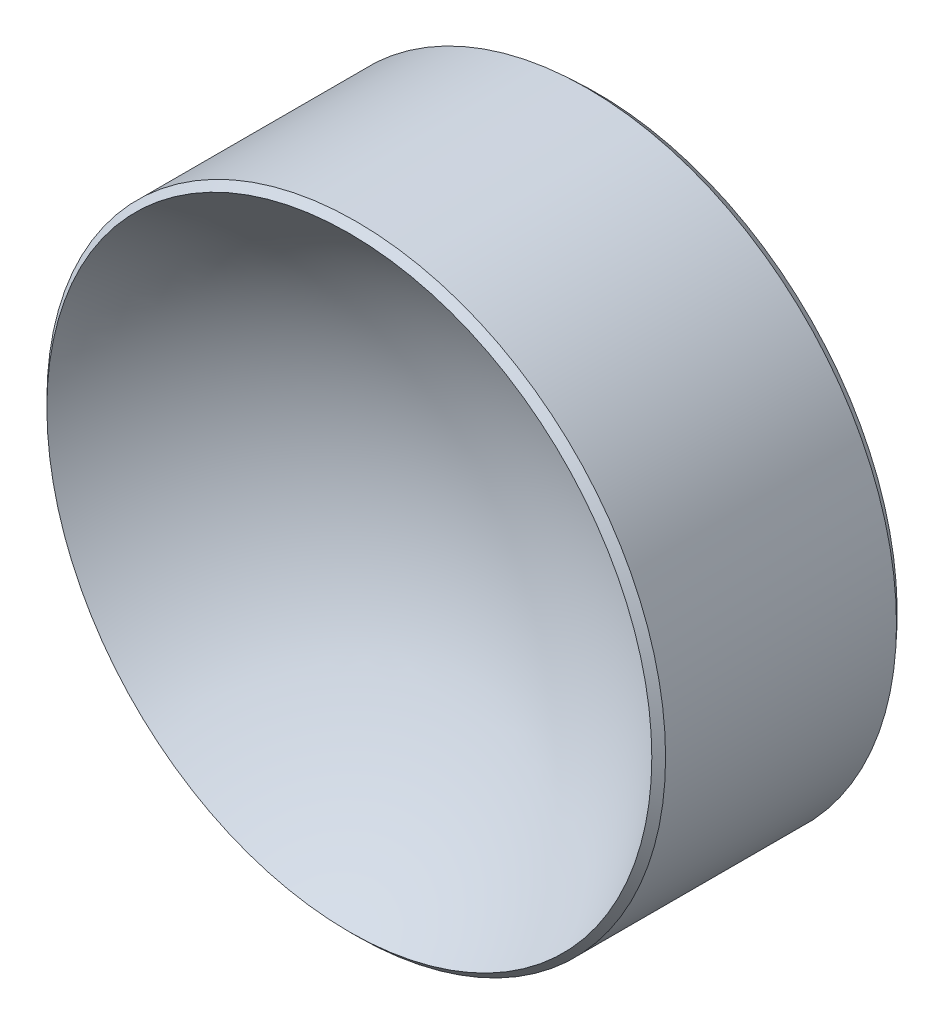
ISO-10303-21;
HEADER;
FILE_DESCRIPTION(('STEP AP214'),'2;1');
FILE_NAME('part.step','',(''),(''),'','','');
FILE_SCHEMA(('AUTOMOTIVE_DESIGN { 1 0 10303 214 1 1 1 1 }'));
ENDSEC;
DATA;
#1=APPLICATION_CONTEXT('core data for automotive mechanical design processes');
#2=APPLICATION_PROTOCOL_DEFINITION('international standard','automotive_design',2000,#1);
#3=PRODUCT_CONTEXT('',#1,'mechanical');
#4=PRODUCT('Part','Part','',(#3));
#5=PRODUCT_RELATED_PRODUCT_CATEGORY('part','',(#4));
#6=PRODUCT_DEFINITION_FORMATION('','',#4);
#7=PRODUCT_DEFINITION_CONTEXT('part definition',#1,'design');
#8=PRODUCT_DEFINITION('design','',#6,#7);
#9=PRODUCT_DEFINITION_SHAPE('','',#8);
#10=(LENGTH_UNIT() NAMED_UNIT(*) SI_UNIT(.MILLI.,.METRE.));
#11=(NAMED_UNIT(*) PLANE_ANGLE_UNIT() SI_UNIT($,.RADIAN.));
#12=(NAMED_UNIT(*) SI_UNIT($,.STERADIAN.) SOLID_ANGLE_UNIT());
#13=UNCERTAINTY_MEASURE_WITH_UNIT(LENGTH_MEASURE(1.E-05),#10,'distance_accuracy_value','');
#14=(GEOMETRIC_REPRESENTATION_CONTEXT(3) GLOBAL_UNCERTAINTY_ASSIGNED_CONTEXT((#13)) GLOBAL_UNIT_ASSIGNED_CONTEXT((#10,
#11,#12)) REPRESENTATION_CONTEXT('',''));
#15=CARTESIAN_POINT('',(0.,0.,0.));
#16=DIRECTION('',(0.,0.,1.));
#17=DIRECTION('',(1.,0.,0.));
#18=AXIS2_PLACEMENT_3D('',#15,#16,#17);
#19=CARTESIAN_POINT('',(0.,0.,6.74546360528074));
#20=DIRECTION('',(0.,0.,1.));
#21=DIRECTION('',(0.,1.,0.));
#22=AXIS2_PLACEMENT_3D('',#19,#20,#21);
#23=SPHERICAL_SURFACE('',#22,7.50000000000001);
#24=CARTESIAN_POINT('',(0.,0.,2.53790478522678));
#25=DIRECTION('',(0.,0.,1.));
#26=DIRECTION('',(0.,-1.,0.));
#27=AXIS2_PLACEMENT_3D('',#24,#25,#26);
#28=CIRCLE('',#27,6.20857864376269);
#29=CARTESIAN_POINT('',(0.,-6.20857864376269,2.53790478522678));
#30=VERTEX_POINT('',#29);
#31=EDGE_CURVE('E28',#30,#30,#28,.T.);
#32=ORIENTED_EDGE('',*,*,#31,.T.);
#33=EDGE_LOOP('',(#32));
#34=FACE_BOUND('',#33,.T.);
#35=ADVANCED_FACE('F13',(#34),#23,.F.);
#36=CARTESIAN_POINT('',(0.,0.,92.8104636052807));
#37=DIRECTION('',(0.,0.,1.));
#38=DIRECTION('',(0.,-1.,0.));
#39=AXIS2_PLACEMENT_3D('',#36,#37,#38);
#40=SPHERICAL_SURFACE('',#39,95.565);
#41=CARTESIAN_POINT('',(0.,0.,-2.55640023880257));
#42=DIRECTION('',(0.,0.,1.));
#43=DIRECTION('',(0.,-1.,0.));
#44=AXIS2_PLACEMENT_3D('',#41,#42,#43);
#45=CIRCLE('',#44,6.15065082280505);
#46=CARTESIAN_POINT('',(0.,-6.15065082280503,-2.55640023880257));
#47=VERTEX_POINT('',#46);
#48=EDGE_CURVE('E9',#47,#47,#45,.F.);
#49=ORIENTED_EDGE('',*,*,#48,.T.);
#50=EDGE_LOOP('',(#49));
#51=FACE_BOUND('',#50,.T.);
#52=ADVANCED_FACE('F43',(#51),#40,.T.);
#53=CARTESIAN_POINT('',(0.,0.,-0.754536394719266));
#54=DIRECTION('',(0.,0.,1.));
#55=DIRECTION('',(0.,-1.,0.));
#56=AXIS2_PLACEMENT_3D('',#53,#54,#55);
#57=CYLINDRICAL_SURFACE('',#56,6.35);
#58=CARTESIAN_POINT('',(0.,0.,-2.34333403802237));
#59=DIRECTION('',(0.,0.,1.));
#60=DIRECTION('',(0.,-1.,0.));
#61=AXIS2_PLACEMENT_3D('',#58,#59,#60);
#62=CIRCLE('',#61,6.35);
#63=CARTESIAN_POINT('',(0.,-6.35,-2.34333403802237));
#64=VERTEX_POINT('',#63);
#65=EDGE_CURVE('E20',#64,#64,#62,.T.);
#66=ORIENTED_EDGE('',*,*,#65,.T.);
#67=EDGE_LOOP('',(#66));
#68=FACE_BOUND('',#67,.T.);
#69=CARTESIAN_POINT('',(0.,0.,2.39648342898948));
#70=DIRECTION('',(0.,0.,1.));
#71=DIRECTION('',(0.,-1.,0.));
#72=AXIS2_PLACEMENT_3D('',#69,#70,#71);
#73=CIRCLE('',#72,6.35);
#74=CARTESIAN_POINT('',(0.,-6.35,2.39648342898948));
#75=VERTEX_POINT('',#74);
#76=EDGE_CURVE('E24',#75,#75,#73,.T.);
#77=ORIENTED_EDGE('',*,*,#76,.F.);
#78=EDGE_LOOP('',(#77));
#79=FACE_BOUND('',#78,.T.);
#80=ADVANCED_FACE('F38',(#68,#79),#57,.T.);
#81=CARTESIAN_POINT('',(0.,0.,2.39648342898948));
#82=DIRECTION('',(0.,0.,-1.));
#83=DIRECTION('',(0.,1.,0.));
#84=AXIS2_PLACEMENT_3D('',#81,#82,#83);
#85=CONICAL_SURFACE('',#84,6.35,0.785398163397454);
#86=ORIENTED_EDGE('',*,*,#31,.F.);
#87=EDGE_LOOP('',(#86));
#88=FACE_BOUND('',#87,.T.);
#89=ORIENTED_EDGE('',*,*,#76,.T.);
#90=EDGE_LOOP('',(#89));
#91=FACE_BOUND('',#90,.T.);
#92=ADVANCED_FACE('F35',(#88,#91),#85,.T.);
#93=CARTESIAN_POINT('',(0.,0.,-2.34333403802237));
#94=DIRECTION('',(0.,0.,1.));
#95=DIRECTION('',(0.,-1.,0.));
#96=AXIS2_PLACEMENT_3D('',#93,#94,#95);
#97=CONICAL_SURFACE('',#96,6.35,0.752150206223259);
#98=ORIENTED_EDGE('',*,*,#48,.F.);
#99=EDGE_LOOP('',(#98));
#100=FACE_BOUND('',#99,.T.);
#101=ORIENTED_EDGE('',*,*,#65,.F.);
#102=EDGE_LOOP('',(#101));
#103=FACE_BOUND('',#102,.T.);
#104=ADVANCED_FACE('F15',(#100,#103),#97,.T.);
#105=CLOSED_SHELL('',(#35,#52,#80,#92,#104));
#106=MANIFOLD_SOLID_BREP('B1',#105);
#107=ADVANCED_BREP_SHAPE_REPRESENTATION('',(#18,#106),#14);
#108=SHAPE_DEFINITION_REPRESENTATION(#9,#107);
ENDSEC;
END-ISO-10303-21;
